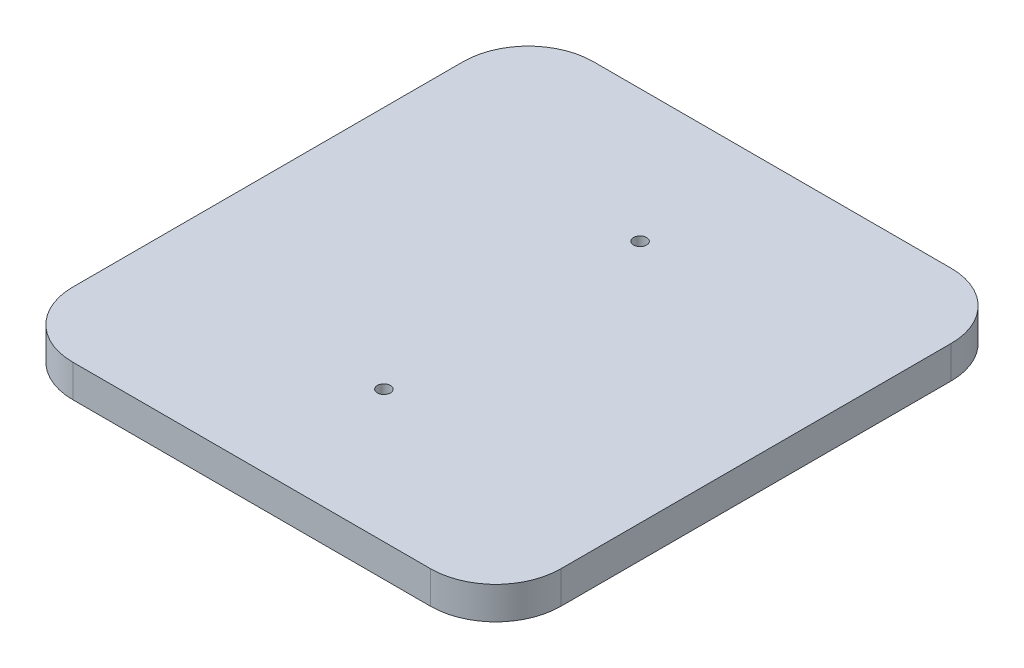
ISO-10303-21;
HEADER;
FILE_DESCRIPTION(('STEP AP214'),'2;1');
FILE_NAME('part.step','',(''),(''),'','','');
FILE_SCHEMA(('AUTOMOTIVE_DESIGN { 1 0 10303 214 1 1 1 1 }'));
ENDSEC;
DATA;
#1=APPLICATION_CONTEXT('core data for automotive mechanical design processes');
#2=APPLICATION_PROTOCOL_DEFINITION('international standard','automotive_design',2000,#1);
#3=PRODUCT_CONTEXT('',#1,'mechanical');
#4=PRODUCT('Part','Part','',(#3));
#5=PRODUCT_RELATED_PRODUCT_CATEGORY('part','',(#4));
#6=PRODUCT_DEFINITION_FORMATION('','',#4);
#7=PRODUCT_DEFINITION_CONTEXT('part definition',#1,'design');
#8=PRODUCT_DEFINITION('design','',#6,#7);
#9=PRODUCT_DEFINITION_SHAPE('','',#8);
#10=(LENGTH_UNIT() NAMED_UNIT(*) SI_UNIT(.MILLI.,.METRE.));
#11=(NAMED_UNIT(*) PLANE_ANGLE_UNIT() SI_UNIT($,.RADIAN.));
#12=(NAMED_UNIT(*) SI_UNIT($,.STERADIAN.) SOLID_ANGLE_UNIT());
#13=UNCERTAINTY_MEASURE_WITH_UNIT(LENGTH_MEASURE(1.E-05),#10,'distance_accuracy_value','');
#14=(GEOMETRIC_REPRESENTATION_CONTEXT(3) GLOBAL_UNCERTAINTY_ASSIGNED_CONTEXT((#13)) GLOBAL_UNIT_ASSIGNED_CONTEXT((#10,
#11,#12)) REPRESENTATION_CONTEXT('',''));
#15=CARTESIAN_POINT('',(0.,0.,0.));
#16=DIRECTION('',(0.,0.,1.));
#17=DIRECTION('',(1.,0.,0.));
#18=AXIS2_PLACEMENT_3D('',#15,#16,#17);
#19=CARTESIAN_POINT('',(25.4,12.7,-25.4));
#20=DIRECTION('',(0.,-1.,0.));
#21=DIRECTION('',(0.,0.,-1.));
#22=AXIS2_PLACEMENT_3D('',#19,#20,#21);
#23=CYLINDRICAL_SURFACE('',#22,25.4);
#24=CARTESIAN_POINT('',(25.4,0.,-25.4));
#25=DIRECTION('',(0.,1.,0.));
#26=DIRECTION('',(0.,0.,1.));
#27=AXIS2_PLACEMENT_3D('',#24,#25,#26);
#28=CIRCLE('',#27,25.4);
#29=CARTESIAN_POINT('',(0.,0.,-25.4000000000002));
#30=VERTEX_POINT('',#29);
#31=CARTESIAN_POINT('',(25.4000000000002,0.,0.));
#32=VERTEX_POINT('',#31);
#33=EDGE_CURVE('E131',#30,#32,#28,.T.);
#34=ORIENTED_EDGE('',*,*,#33,.T.);
#35=DIRECTION('',(0.,-1.,0.));
#36=VECTOR('',#35,1.);
#37=CARTESIAN_POINT('',(25.4000000000002,12.7,0.));
#38=LINE('',#37,#36);
#39=CARTESIAN_POINT('',(25.4000000000002,12.7,0.));
#40=VERTEX_POINT('',#39);
#41=EDGE_CURVE('E11',#40,#32,#38,.T.);
#42=ORIENTED_EDGE('',*,*,#41,.F.);
#43=CARTESIAN_POINT('',(25.4,12.7,-25.4));
#44=DIRECTION('',(0.,1.,0.));
#45=DIRECTION('',(0.,0.,1.));
#46=AXIS2_PLACEMENT_3D('',#43,#44,#45);
#47=CIRCLE('',#46,25.4);
#48=CARTESIAN_POINT('',(0.,12.7,-25.4000000000002));
#49=VERTEX_POINT('',#48);
#50=EDGE_CURVE('E146',#49,#40,#47,.T.);
#51=ORIENTED_EDGE('',*,*,#50,.F.);
#52=DIRECTION('',(0.,-1.,0.));
#53=VECTOR('',#52,1.);
#54=CARTESIAN_POINT('',(0.,12.7,-25.4000000000002));
#55=LINE('',#54,#53);
#56=EDGE_CURVE('E127',#49,#30,#55,.T.);
#57=ORIENTED_EDGE('',*,*,#56,.T.);
#58=EDGE_LOOP('',(#34,#42,#51,#57));
#59=FACE_BOUND('',#58,.T.);
#60=ADVANCED_FACE('F35',(#59),#23,.T.);
#61=CARTESIAN_POINT('',(25.4000000000002,12.7,0.));
#62=DIRECTION('',(0.,0.,-1.));
#63=DIRECTION('',(-1.,0.,0.));
#64=AXIS2_PLACEMENT_3D('',#61,#62,#63);
#65=PLANE('',#64);
#66=DIRECTION('',(1.,0.,0.));
#67=VECTOR('',#66,1.);
#68=CARTESIAN_POINT('',(25.4000000000002,0.,0.));
#69=LINE('',#68,#67);
#70=CARTESIAN_POINT('',(165.1,0.,0.));
#71=VERTEX_POINT('',#70);
#72=EDGE_CURVE('E134',#32,#71,#69,.T.);
#73=ORIENTED_EDGE('',*,*,#72,.T.);
#74=DIRECTION('',(0.,-1.,0.));
#75=VECTOR('',#74,1.);
#76=CARTESIAN_POINT('',(165.1,12.7,0.));
#77=LINE('',#76,#75);
#78=CARTESIAN_POINT('',(165.1,12.7,0.));
#79=VERTEX_POINT('',#78);
#80=EDGE_CURVE('E43',#79,#71,#77,.T.);
#81=ORIENTED_EDGE('',*,*,#80,.F.);
#82=DIRECTION('',(1.,0.,0.));
#83=VECTOR('',#82,1.);
#84=CARTESIAN_POINT('',(25.4000000000002,12.7,0.));
#85=LINE('',#84,#83);
#86=EDGE_CURVE('E94',#40,#79,#85,.T.);
#87=ORIENTED_EDGE('',*,*,#86,.F.);
#88=ORIENTED_EDGE('',*,*,#41,.T.);
#89=EDGE_LOOP('',(#73,#81,#87,#88));
#90=FACE_BOUND('',#89,.T.);
#91=ADVANCED_FACE('F213',(#90),#65,.F.);
#92=CARTESIAN_POINT('',(165.1,12.7,-25.4));
#93=DIRECTION('',(0.,-1.,0.));
#94=DIRECTION('',(0.,0.,-1.));
#95=AXIS2_PLACEMENT_3D('',#92,#93,#94);
#96=CYLINDRICAL_SURFACE('',#95,25.4);
#97=CARTESIAN_POINT('',(165.1,0.,-25.4));
#98=DIRECTION('',(0.,1.,0.));
#99=DIRECTION('',(0.,0.,1.));
#100=AXIS2_PLACEMENT_3D('',#97,#98,#99);
#101=CIRCLE('',#100,25.4);
#102=CARTESIAN_POINT('',(190.5,0.,-25.4000000000002));
#103=VERTEX_POINT('',#102);
#104=EDGE_CURVE('E137',#71,#103,#101,.T.);
#105=ORIENTED_EDGE('',*,*,#104,.T.);
#106=DIRECTION('',(0.,-1.,0.));
#107=VECTOR('',#106,1.);
#108=CARTESIAN_POINT('',(190.5,12.7,-25.4000000000002));
#109=LINE('',#108,#107);
#110=CARTESIAN_POINT('',(190.5,12.7,-25.4000000000002));
#111=VERTEX_POINT('',#110);
#112=EDGE_CURVE('E153',#111,#103,#109,.T.);
#113=ORIENTED_EDGE('',*,*,#112,.F.);
#114=CARTESIAN_POINT('',(165.1,12.7,-25.4));
#115=DIRECTION('',(0.,1.,0.));
#116=DIRECTION('',(0.,0.,1.));
#117=AXIS2_PLACEMENT_3D('',#114,#115,#116);
#118=CIRCLE('',#117,25.4);
#119=EDGE_CURVE('E161',#79,#111,#118,.T.);
#120=ORIENTED_EDGE('',*,*,#119,.F.);
#121=ORIENTED_EDGE('',*,*,#80,.T.);
#122=EDGE_LOOP('',(#105,#113,#120,#121));
#123=FACE_BOUND('',#122,.T.);
#124=ADVANCED_FACE('F159',(#123),#96,.T.);
#125=CARTESIAN_POINT('',(190.5,12.7,-25.4000000000002));
#126=DIRECTION('',(-1.,0.,0.));
#127=DIRECTION('',(0.,0.,1.));
#128=AXIS2_PLACEMENT_3D('',#125,#126,#127);
#129=PLANE('',#128);
#130=DIRECTION('',(0.,0.,-1.));
#131=VECTOR('',#130,1.);
#132=CARTESIAN_POINT('',(190.5,0.,-25.4000000000002));
#133=LINE('',#132,#131);
#134=CARTESIAN_POINT('',(190.5,0.,-177.8));
#135=VERTEX_POINT('',#134);
#136=EDGE_CURVE('E139',#103,#135,#133,.T.);
#137=ORIENTED_EDGE('',*,*,#136,.T.);
#138=DIRECTION('',(0.,-1.,0.));
#139=VECTOR('',#138,1.);
#140=CARTESIAN_POINT('',(190.5,12.7,-177.8));
#141=LINE('',#140,#139);
#142=CARTESIAN_POINT('',(190.5,12.7,-177.8));
#143=VERTEX_POINT('',#142);
#144=EDGE_CURVE('E150',#143,#135,#141,.T.);
#145=ORIENTED_EDGE('',*,*,#144,.F.);
#146=DIRECTION('',(0.,0.,-1.));
#147=VECTOR('',#146,1.);
#148=CARTESIAN_POINT('',(190.5,12.7,-25.4000000000002));
#149=LINE('',#148,#147);
#150=EDGE_CURVE('E173',#111,#143,#149,.T.);
#151=ORIENTED_EDGE('',*,*,#150,.F.);
#152=ORIENTED_EDGE('',*,*,#112,.T.);
#153=EDGE_LOOP('',(#137,#145,#151,#152));
#154=FACE_BOUND('',#153,.T.);
#155=ADVANCED_FACE('F169',(#154),#129,.F.);
#156=CARTESIAN_POINT('',(165.1,12.7,-177.8));
#157=DIRECTION('',(0.,-1.,0.));
#158=DIRECTION('',(0.,0.,-1.));
#159=AXIS2_PLACEMENT_3D('',#156,#157,#158);
#160=CYLINDRICAL_SURFACE('',#159,25.4);
#161=CARTESIAN_POINT('',(165.1,0.,-177.8));
#162=DIRECTION('',(0.,1.,0.));
#163=DIRECTION('',(0.,0.,1.));
#164=AXIS2_PLACEMENT_3D('',#161,#162,#163);
#165=CIRCLE('',#164,25.4);
#166=CARTESIAN_POINT('',(165.1,0.,-203.2));
#167=VERTEX_POINT('',#166);
#168=EDGE_CURVE('E141',#135,#167,#165,.T.);
#169=ORIENTED_EDGE('',*,*,#168,.T.);
#170=DIRECTION('',(0.,-1.,0.));
#171=VECTOR('',#170,1.);
#172=CARTESIAN_POINT('',(165.1,12.7,-203.2));
#173=LINE('',#172,#171);
#174=CARTESIAN_POINT('',(165.1,12.7,-203.2));
#175=VERTEX_POINT('',#174);
#176=EDGE_CURVE('E122',#175,#167,#173,.T.);
#177=ORIENTED_EDGE('',*,*,#176,.F.);
#178=CARTESIAN_POINT('',(165.1,12.7,-177.8));
#179=DIRECTION('',(0.,1.,0.));
#180=DIRECTION('',(0.,0.,1.));
#181=AXIS2_PLACEMENT_3D('',#178,#179,#180);
#182=CIRCLE('',#181,25.4);
#183=EDGE_CURVE('E113',#143,#175,#182,.T.);
#184=ORIENTED_EDGE('',*,*,#183,.F.);
#185=ORIENTED_EDGE('',*,*,#144,.T.);
#186=EDGE_LOOP('',(#169,#177,#184,#185));
#187=FACE_BOUND('',#186,.T.);
#188=ADVANCED_FACE('F172',(#187),#160,.T.);
#189=CARTESIAN_POINT('',(25.4000000000002,12.7,-203.2));
#190=DIRECTION('',(0.,0.,1.));
#191=DIRECTION('',(1.,0.,0.));
#192=AXIS2_PLACEMENT_3D('',#189,#190,#191);
#193=PLANE('',#192);
#194=DIRECTION('',(-1.,0.,0.));
#195=VECTOR('',#194,1.);
#196=CARTESIAN_POINT('',(25.4000000000002,0.,-203.2));
#197=LINE('',#196,#195);
#198=CARTESIAN_POINT('',(25.4000000000002,0.,-203.2));
#199=VERTEX_POINT('',#198);
#200=EDGE_CURVE('E121',#167,#199,#197,.T.);
#201=ORIENTED_EDGE('',*,*,#200,.T.);
#202=DIRECTION('',(0.,-1.,0.));
#203=VECTOR('',#202,1.);
#204=CARTESIAN_POINT('',(25.4000000000002,12.7,-203.2));
#205=LINE('',#204,#203);
#206=CARTESIAN_POINT('',(25.4000000000002,12.7,-203.2));
#207=VERTEX_POINT('',#206);
#208=EDGE_CURVE('E118',#207,#199,#205,.T.);
#209=ORIENTED_EDGE('',*,*,#208,.F.);
#210=DIRECTION('',(-1.,0.,0.));
#211=VECTOR('',#210,1.);
#212=CARTESIAN_POINT('',(25.4000000000002,12.7,-203.2));
#213=LINE('',#212,#211);
#214=EDGE_CURVE('E107',#175,#207,#213,.T.);
#215=ORIENTED_EDGE('',*,*,#214,.F.);
#216=ORIENTED_EDGE('',*,*,#176,.T.);
#217=EDGE_LOOP('',(#201,#209,#215,#216));
#218=FACE_BOUND('',#217,.T.);
#219=ADVANCED_FACE('F119',(#218),#193,.F.);
#220=CARTESIAN_POINT('',(25.4,12.7,-177.8));
#221=DIRECTION('',(0.,-1.,0.));
#222=DIRECTION('',(0.,0.,-1.));
#223=AXIS2_PLACEMENT_3D('',#220,#221,#222);
#224=CYLINDRICAL_SURFACE('',#223,25.4);
#225=CARTESIAN_POINT('',(25.4,0.,-177.8));
#226=DIRECTION('',(0.,1.,0.));
#227=DIRECTION('',(0.,0.,1.));
#228=AXIS2_PLACEMENT_3D('',#225,#226,#227);
#229=CIRCLE('',#228,25.4);
#230=CARTESIAN_POINT('',(0.,0.,-177.8));
#231=VERTEX_POINT('',#230);
#232=EDGE_CURVE('E80',#199,#231,#229,.T.);
#233=ORIENTED_EDGE('',*,*,#232,.T.);
#234=DIRECTION('',(0.,-1.,0.));
#235=VECTOR('',#234,1.);
#236=CARTESIAN_POINT('',(0.,12.7,-177.8));
#237=LINE('',#236,#235);
#238=CARTESIAN_POINT('',(0.,12.7,-177.8));
#239=VERTEX_POINT('',#238);
#240=EDGE_CURVE('E123',#239,#231,#237,.T.);
#241=ORIENTED_EDGE('',*,*,#240,.F.);
#242=CARTESIAN_POINT('',(25.4,12.7,-177.8));
#243=DIRECTION('',(0.,1.,0.));
#244=DIRECTION('',(0.,0.,1.));
#245=AXIS2_PLACEMENT_3D('',#242,#243,#244);
#246=CIRCLE('',#245,25.4);
#247=EDGE_CURVE('E111',#207,#239,#246,.T.);
#248=ORIENTED_EDGE('',*,*,#247,.F.);
#249=ORIENTED_EDGE('',*,*,#208,.T.);
#250=EDGE_LOOP('',(#233,#241,#248,#249));
#251=FACE_BOUND('',#250,.T.);
#252=ADVANCED_FACE('F125',(#251),#224,.T.);
#253=CARTESIAN_POINT('',(0.,12.7,-25.4000000000002));
#254=DIRECTION('',(1.,0.,0.));
#255=DIRECTION('',(0.,0.,-1.));
#256=AXIS2_PLACEMENT_3D('',#253,#254,#255);
#257=PLANE('',#256);
#258=DIRECTION('',(0.,0.,1.));
#259=VECTOR('',#258,1.);
#260=CARTESIAN_POINT('',(0.,0.,-25.4000000000002));
#261=LINE('',#260,#259);
#262=EDGE_CURVE('E86',#231,#30,#261,.T.);
#263=ORIENTED_EDGE('',*,*,#262,.T.);
#264=ORIENTED_EDGE('',*,*,#56,.F.);
#265=DIRECTION('',(0.,0.,1.));
#266=VECTOR('',#265,1.);
#267=CARTESIAN_POINT('',(0.,12.7,-25.4000000000002));
#268=LINE('',#267,#266);
#269=EDGE_CURVE('E51',#239,#49,#268,.T.);
#270=ORIENTED_EDGE('',*,*,#269,.F.);
#271=ORIENTED_EDGE('',*,*,#240,.T.);
#272=EDGE_LOOP('',(#263,#264,#270,#271));
#273=FACE_BOUND('',#272,.T.);
#274=ADVANCED_FACE('F196',(#273),#257,.F.);
#275=CARTESIAN_POINT('',(25.4,12.7,-25.4));
#276=DIRECTION('',(0.,1.,0.));
#277=DIRECTION('',(0.,0.,1.));
#278=AXIS2_PLACEMENT_3D('',#275,#276,#277);
#279=PLANE('',#278);
#280=CARTESIAN_POINT('',(95.2499999999999,12.7,-151.6));
#281=DIRECTION('',(0.,1.,0.));
#282=DIRECTION('',(0.,0.,1.));
#283=AXIS2_PLACEMENT_3D('',#280,#281,#282);
#284=CIRCLE('',#283,2.55269999999999);
#285=CARTESIAN_POINT('',(95.2499999999999,12.7,-149.0473));
#286=VERTEX_POINT('',#285);
#287=EDGE_CURVE('E187',#286,#286,#284,.T.);
#288=ORIENTED_EDGE('',*,*,#287,.F.);
#289=EDGE_LOOP('',(#288));
#290=FACE_BOUND('',#289,.T.);
#291=CARTESIAN_POINT('',(95.25,12.7,-51.6));
#292=DIRECTION('',(0.,1.,0.));
#293=DIRECTION('',(0.,0.,1.));
#294=AXIS2_PLACEMENT_3D('',#291,#292,#293);
#295=CIRCLE('',#294,2.55269999999999);
#296=CARTESIAN_POINT('',(95.25,12.7,-49.0473));
#297=VERTEX_POINT('',#296);
#298=EDGE_CURVE('E181',#297,#297,#295,.T.);
#299=ORIENTED_EDGE('',*,*,#298,.F.);
#300=EDGE_LOOP('',(#299));
#301=FACE_BOUND('',#300,.T.);
#302=ORIENTED_EDGE('',*,*,#50,.T.);
#303=ORIENTED_EDGE('',*,*,#86,.T.);
#304=ORIENTED_EDGE('',*,*,#119,.T.);
#305=ORIENTED_EDGE('',*,*,#150,.T.);
#306=ORIENTED_EDGE('',*,*,#183,.T.);
#307=ORIENTED_EDGE('',*,*,#214,.T.);
#308=ORIENTED_EDGE('',*,*,#247,.T.);
#309=ORIENTED_EDGE('',*,*,#269,.T.);
#310=EDGE_LOOP('',(#302,#303,#304,#305,#306,#307,#308,#309));
#311=FACE_BOUND('',#310,.T.);
#312=ADVANCED_FACE('F109',(#290,#301,#311),#279,.T.);
#313=CARTESIAN_POINT('',(25.4,0.,-25.4));
#314=DIRECTION('',(0.,1.,0.));
#315=DIRECTION('',(0.,0.,1.));
#316=AXIS2_PLACEMENT_3D('',#313,#314,#315);
#317=PLANE('',#316);
#318=CARTESIAN_POINT('',(95.2499999999999,0.,-151.6));
#319=DIRECTION('',(0.,1.,0.));
#320=DIRECTION('',(0.,0.,1.));
#321=AXIS2_PLACEMENT_3D('',#318,#319,#320);
#322=CIRCLE('',#321,2.55269999999999);
#323=CARTESIAN_POINT('',(95.2499999999999,0.,-149.0473));
#324=VERTEX_POINT('',#323);
#325=EDGE_CURVE('E184',#324,#324,#322,.T.);
#326=ORIENTED_EDGE('',*,*,#325,.T.);
#327=EDGE_LOOP('',(#326));
#328=FACE_BOUND('',#327,.T.);
#329=CARTESIAN_POINT('',(95.25,0.,-51.6));
#330=DIRECTION('',(0.,1.,0.));
#331=DIRECTION('',(0.,0.,1.));
#332=AXIS2_PLACEMENT_3D('',#329,#330,#331);
#333=CIRCLE('',#332,2.55269999999999);
#334=CARTESIAN_POINT('',(95.25,0.,-49.0473));
#335=VERTEX_POINT('',#334);
#336=EDGE_CURVE('E135',#335,#335,#333,.T.);
#337=ORIENTED_EDGE('',*,*,#336,.T.);
#338=EDGE_LOOP('',(#337));
#339=FACE_BOUND('',#338,.T.);
#340=ORIENTED_EDGE('',*,*,#33,.F.);
#341=ORIENTED_EDGE('',*,*,#262,.F.);
#342=ORIENTED_EDGE('',*,*,#232,.F.);
#343=ORIENTED_EDGE('',*,*,#200,.F.);
#344=ORIENTED_EDGE('',*,*,#168,.F.);
#345=ORIENTED_EDGE('',*,*,#136,.F.);
#346=ORIENTED_EDGE('',*,*,#104,.F.);
#347=ORIENTED_EDGE('',*,*,#72,.F.);
#348=EDGE_LOOP('',(#340,#341,#342,#343,#344,#345,#346,#347));
#349=FACE_BOUND('',#348,.T.);
#350=ADVANCED_FACE('F165',(#328,#339,#349),#317,.F.);
#351=CARTESIAN_POINT('',(95.25,12.7,-51.6));
#352=DIRECTION('',(0.,1.,0.));
#353=DIRECTION('',(0.,0.,1.));
#354=AXIS2_PLACEMENT_3D('',#351,#352,#353);
#355=CYLINDRICAL_SURFACE('',#354,2.55269999999999);
#356=ORIENTED_EDGE('',*,*,#298,.T.);
#357=EDGE_LOOP('',(#356));
#358=FACE_BOUND('',#357,.T.);
#359=ORIENTED_EDGE('',*,*,#336,.F.);
#360=EDGE_LOOP('',(#359));
#361=FACE_BOUND('',#360,.T.);
#362=ADVANCED_FACE('F200',(#358,#361),#355,.F.);
#363=CARTESIAN_POINT('',(95.2499999999999,12.7,-151.6));
#364=DIRECTION('',(0.,1.,0.));
#365=DIRECTION('',(0.,0.,1.));
#366=AXIS2_PLACEMENT_3D('',#363,#364,#365);
#367=CYLINDRICAL_SURFACE('',#366,2.55269999999999);
#368=ORIENTED_EDGE('',*,*,#287,.T.);
#369=EDGE_LOOP('',(#368));
#370=FACE_BOUND('',#369,.T.);
#371=ORIENTED_EDGE('',*,*,#325,.F.);
#372=EDGE_LOOP('',(#371));
#373=FACE_BOUND('',#372,.T.);
#374=ADVANCED_FACE('F191',(#370,#373),#367,.F.);
#375=CLOSED_SHELL('',(#60,#91,#124,#155,#188,#219,#252,#274,#312,#350,#362,#374));
#376=MANIFOLD_SOLID_BREP('B2',#375);
#377=ADVANCED_BREP_SHAPE_REPRESENTATION('',(#18,#376),#14);
#378=SHAPE_DEFINITION_REPRESENTATION(#9,#377);
ENDSEC;
END-ISO-10303-21;
